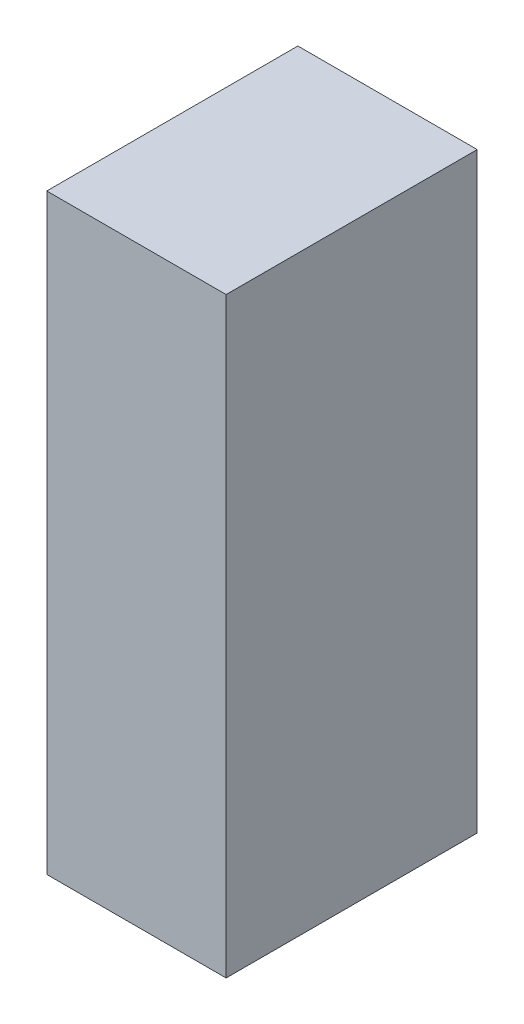
ISO-10303-21;
HEADER;
FILE_DESCRIPTION(('STEP AP214'),'2;1');
FILE_NAME('part.step','',(''),(''),'','','');
FILE_SCHEMA(('AUTOMOTIVE_DESIGN { 1 0 10303 214 1 1 1 1 }'));
ENDSEC;
DATA;
#1=APPLICATION_CONTEXT('core data for automotive mechanical design processes');
#2=APPLICATION_PROTOCOL_DEFINITION('international standard','automotive_design',2000,#1);
#3=PRODUCT_CONTEXT('',#1,'mechanical');
#4=PRODUCT('Part','Part','',(#3));
#5=PRODUCT_RELATED_PRODUCT_CATEGORY('part','',(#4));
#6=PRODUCT_DEFINITION_FORMATION('','',#4);
#7=PRODUCT_DEFINITION_CONTEXT('part definition',#1,'design');
#8=PRODUCT_DEFINITION('design','',#6,#7);
#9=PRODUCT_DEFINITION_SHAPE('','',#8);
#10=(LENGTH_UNIT() NAMED_UNIT(*) SI_UNIT(.MILLI.,.METRE.));
#11=(NAMED_UNIT(*) PLANE_ANGLE_UNIT() SI_UNIT($,.RADIAN.));
#12=(NAMED_UNIT(*) SI_UNIT($,.STERADIAN.) SOLID_ANGLE_UNIT());
#13=UNCERTAINTY_MEASURE_WITH_UNIT(LENGTH_MEASURE(1.E-05),#10,'distance_accuracy_value','');
#14=(GEOMETRIC_REPRESENTATION_CONTEXT(3) GLOBAL_UNCERTAINTY_ASSIGNED_CONTEXT((#13)) GLOBAL_UNIT_ASSIGNED_CONTEXT((#10,
#11,#12)) REPRESENTATION_CONTEXT('',''));
#15=CARTESIAN_POINT('',(0.,0.,0.));
#16=DIRECTION('',(0.,0.,1.));
#17=DIRECTION('',(1.,0.,0.));
#18=AXIS2_PLACEMENT_3D('',#15,#16,#17);
#19=CARTESIAN_POINT('',(1.12500740603842,-0.825002192515939,-2.84112203121185));
#20=DIRECTION('',(-4.37113882867379E-08,-1.,0.));
#21=DIRECTION('',(1.,-4.37113882867379E-08,0.));
#22=AXIS2_PLACEMENT_3D('',#19,#20,#21);
#23=PLANE('',#22);
#24=DIRECTION('',(0.999999999999999,-4.3711388325877E-08,0.));
#25=VECTOR('',#24,1.);
#26=CARTESIAN_POINT('',(1.12500740603842,-0.825002192515939,-2.84112203121185));
#27=LINE('',#26,#25);
#28=CARTESIAN_POINT('',(1.12500740603842,-0.825002192515939,-2.84112203121185));
#29=VERTEX_POINT('',#28);
#30=CARTESIAN_POINT('',(1.62501503543295,-0.825002214371949,-2.84112203121185));
#31=VERTEX_POINT('',#30);
#32=EDGE_CURVE('E11',#29,#31,#27,.T.);
#33=ORIENTED_EDGE('',*,*,#32,.T.);
#34=DIRECTION('',(0.,0.,1.));
#35=VECTOR('',#34,1.);
#36=CARTESIAN_POINT('',(1.62501503543295,-0.825002214371966,-2.84112203121185));
#37=LINE('',#36,#35);
#38=CARTESIAN_POINT('',(1.62501503543295,-0.825002214371949,-2.14112091064453));
#39=VERTEX_POINT('',#38);
#40=EDGE_CURVE('E88',#31,#39,#37,.T.);
#41=ORIENTED_EDGE('',*,*,#40,.T.);
#42=DIRECTION('',(0.999999999999999,-4.3711388325877E-08,0.));
#43=VECTOR('',#42,1.);
#44=CARTESIAN_POINT('',(1.12500740603842,-0.825002192515939,-2.14112091064453));
#45=LINE('',#44,#43);
#46=CARTESIAN_POINT('',(1.12500740603842,-0.825002192515939,-2.14112091064453));
#47=VERTEX_POINT('',#46);
#48=EDGE_CURVE('E83',#47,#39,#45,.T.);
#49=ORIENTED_EDGE('',*,*,#48,.F.);
#50=DIRECTION('',(0.,0.,1.));
#51=VECTOR('',#50,1.);
#52=CARTESIAN_POINT('',(1.12500740603842,-0.825002192515938,-2.84112203121185));
#53=LINE('',#52,#51);
#54=EDGE_CURVE('E72',#29,#47,#53,.T.);
#55=ORIENTED_EDGE('',*,*,#54,.F.);
#56=EDGE_LOOP('',(#33,#41,#49,#55));
#57=FACE_BOUND('',#56,.T.);
#58=ADVANCED_FACE('F17',(#57),#23,.T.);
#59=CARTESIAN_POINT('',(1.62501503543295,-0.825002214371949,-2.84112203121185));
#60=DIRECTION('',(1.,-4.37113882867379E-08,0.));
#61=DIRECTION('',(4.37113882867379E-08,1.,0.));
#62=AXIS2_PLACEMENT_3D('',#59,#60,#61);
#63=PLANE('',#62);
#64=DIRECTION('',(4.37113882740561E-08,0.999999999999999,0.));
#65=VECTOR('',#64,1.);
#66=CARTESIAN_POINT('',(1.62501503543295,-0.825002214371949,-2.84112203121185));
#67=LINE('',#66,#65);
#68=CARTESIAN_POINT('',(1.62501510755715,0.825006940901488,-2.84112203121185));
#69=VERTEX_POINT('',#68);
#70=EDGE_CURVE('E24',#31,#69,#67,.T.);
#71=ORIENTED_EDGE('',*,*,#70,.T.);
#72=DIRECTION('',(0.,0.,1.));
#73=VECTOR('',#72,1.);
#74=CARTESIAN_POINT('',(1.62501510755714,0.825006940901488,-2.84112203121185));
#75=LINE('',#74,#73);
#76=CARTESIAN_POINT('',(1.62501510755715,0.825006940901488,-2.14112091064453));
#77=VERTEX_POINT('',#76);
#78=EDGE_CURVE('E85',#69,#77,#75,.T.);
#79=ORIENTED_EDGE('',*,*,#78,.T.);
#80=DIRECTION('',(4.37113882740561E-08,0.999999999999999,0.));
#81=VECTOR('',#80,1.);
#82=CARTESIAN_POINT('',(1.62501503543295,-0.825002214371949,-2.14112091064453));
#83=LINE('',#82,#81);
#84=EDGE_CURVE('E66',#39,#77,#83,.T.);
#85=ORIENTED_EDGE('',*,*,#84,.F.);
#86=ORIENTED_EDGE('',*,*,#40,.F.);
#87=EDGE_LOOP('',(#71,#79,#85,#86));
#88=FACE_BOUND('',#87,.T.);
#89=ADVANCED_FACE('F89',(#88),#63,.T.);
#90=CARTESIAN_POINT('',(1.62501510755715,0.825006940901488,-2.84112203121185));
#91=DIRECTION('',(4.37113882867379E-08,1.,0.));
#92=DIRECTION('',(-1.,4.37113882867379E-08,0.));
#93=AXIS2_PLACEMENT_3D('',#90,#91,#92);
#94=PLANE('',#93);
#95=DIRECTION('',(-0.999999999999999,4.3711388325877E-08,0.));
#96=VECTOR('',#95,1.);
#97=CARTESIAN_POINT('',(1.62501510755715,0.825006940901488,-2.84112203121185));
#98=LINE('',#97,#96);
#99=CARTESIAN_POINT('',(1.12500747816262,0.825006962757499,-2.84112203121185));
#100=VERTEX_POINT('',#99);
#101=EDGE_CURVE('E62',#69,#100,#98,.T.);
#102=ORIENTED_EDGE('',*,*,#101,.T.);
#103=DIRECTION('',(0.,0.,1.));
#104=VECTOR('',#103,1.);
#105=CARTESIAN_POINT('',(1.12500747816262,0.825006962757516,-2.84112203121185));
#106=LINE('',#105,#104);
#107=CARTESIAN_POINT('',(1.12500747816262,0.825006962757499,-2.14112091064453));
#108=VERTEX_POINT('',#107);
#109=EDGE_CURVE('E55',#100,#108,#106,.T.);
#110=ORIENTED_EDGE('',*,*,#109,.T.);
#111=DIRECTION('',(-0.999999999999999,4.3711388325877E-08,0.));
#112=VECTOR('',#111,1.);
#113=CARTESIAN_POINT('',(1.62501510755715,0.825006940901488,-2.14112091064453));
#114=LINE('',#113,#112);
#115=EDGE_CURVE('E59',#77,#108,#114,.T.);
#116=ORIENTED_EDGE('',*,*,#115,.F.);
#117=ORIENTED_EDGE('',*,*,#78,.F.);
#118=EDGE_LOOP('',(#102,#110,#116,#117));
#119=FACE_BOUND('',#118,.T.);
#120=ADVANCED_FACE('F57',(#119),#94,.T.);
#121=CARTESIAN_POINT('',(1.12500747816262,0.825006962757499,-2.84112203121185));
#122=DIRECTION('',(-1.,4.37113882867379E-08,0.));
#123=DIRECTION('',(-4.37113882867379E-08,-1.,0.));
#124=AXIS2_PLACEMENT_3D('',#121,#122,#123);
#125=PLANE('',#124);
#126=DIRECTION('',(-4.37113882740561E-08,-0.999999999999999,0.));
#127=VECTOR('',#126,1.);
#128=CARTESIAN_POINT('',(1.12500747816262,0.825006962757499,-2.84112203121185));
#129=LINE('',#128,#127);
#130=EDGE_CURVE('E65',#100,#29,#129,.T.);
#131=ORIENTED_EDGE('',*,*,#130,.T.);
#132=ORIENTED_EDGE('',*,*,#54,.T.);
#133=DIRECTION('',(-4.37113882740561E-08,-0.999999999999999,0.));
#134=VECTOR('',#133,1.);
#135=CARTESIAN_POINT('',(1.12500747816262,0.825006962757499,-2.14112091064453));
#136=LINE('',#135,#134);
#137=EDGE_CURVE('E70',#108,#47,#136,.T.);
#138=ORIENTED_EDGE('',*,*,#137,.F.);
#139=ORIENTED_EDGE('',*,*,#109,.F.);
#140=EDGE_LOOP('',(#131,#132,#138,#139));
#141=FACE_BOUND('',#140,.T.);
#142=ADVANCED_FACE('F71',(#141),#125,.T.);
#143=CARTESIAN_POINT('',(-118.849983215332,178.824996948242,-2.14112091064453));
#144=DIRECTION('',(0.,0.,1.));
#145=DIRECTION('',(-4.37113882867379E-08,-1.,0.));
#146=AXIS2_PLACEMENT_3D('',#143,#144,#145);
#147=PLANE('',#146);
#148=ORIENTED_EDGE('',*,*,#48,.T.);
#149=ORIENTED_EDGE('',*,*,#84,.T.);
#150=ORIENTED_EDGE('',*,*,#115,.T.);
#151=ORIENTED_EDGE('',*,*,#137,.T.);
#152=EDGE_LOOP('',(#148,#149,#150,#151));
#153=FACE_BOUND('',#152,.T.);
#154=ADVANCED_FACE('F76',(#153),#147,.T.);
#155=CARTESIAN_POINT('',(-118.849983215332,178.824996948242,-2.84112203121185));
#156=DIRECTION('',(0.,0.,1.));
#157=DIRECTION('',(-4.37113882867379E-08,-1.,0.));
#158=AXIS2_PLACEMENT_3D('',#155,#156,#157);
#159=PLANE('',#158);
#160=ORIENTED_EDGE('',*,*,#130,.F.);
#161=ORIENTED_EDGE('',*,*,#101,.F.);
#162=ORIENTED_EDGE('',*,*,#70,.F.);
#163=ORIENTED_EDGE('',*,*,#32,.F.);
#164=EDGE_LOOP('',(#160,#161,#162,#163));
#165=FACE_BOUND('',#164,.T.);
#166=ADVANCED_FACE('F91',(#165),#159,.F.);
#167=CLOSED_SHELL('',(#58,#89,#120,#142,#154,#166));
#168=MANIFOLD_SOLID_BREP('B1',#167);
#169=ADVANCED_BREP_SHAPE_REPRESENTATION('',(#18,#168),#14);
#170=SHAPE_DEFINITION_REPRESENTATION(#9,#169);
ENDSEC;
END-ISO-10303-21;
